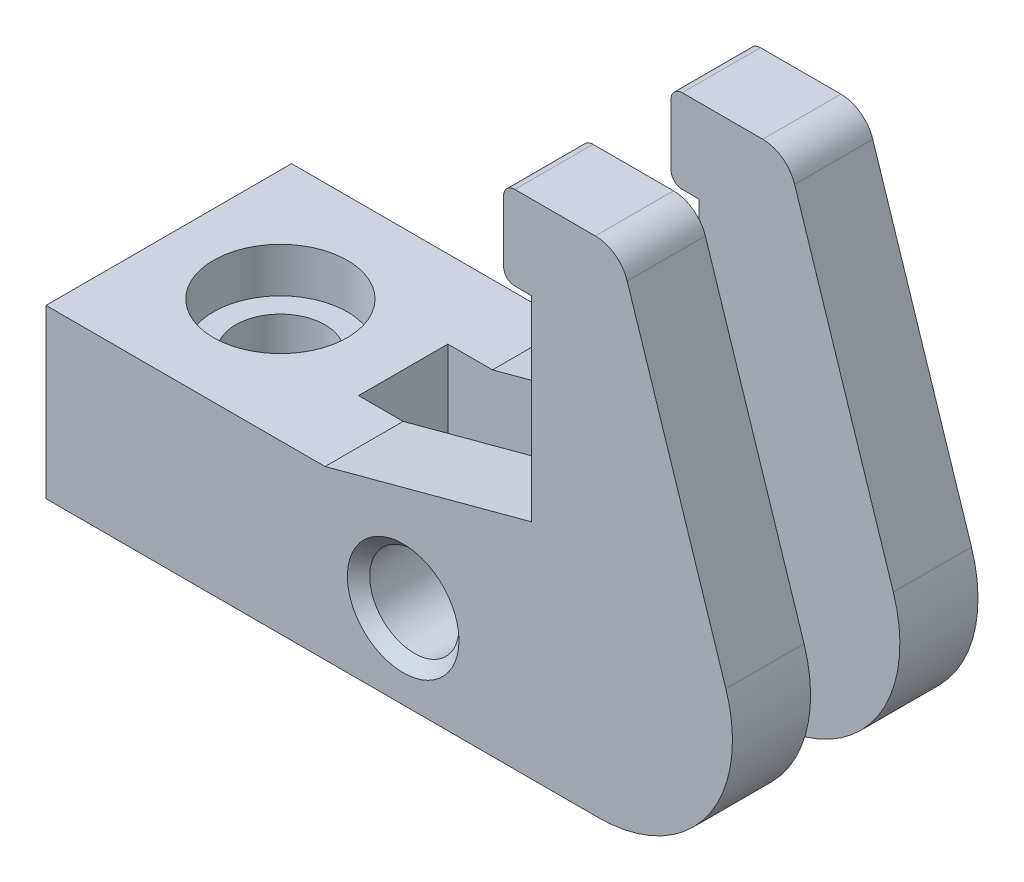
ISO-10303-21;
HEADER;
FILE_DESCRIPTION(('STEP AP214'),'2;1');
FILE_NAME('part.step','',(''),(''),'','','');
FILE_SCHEMA(('AUTOMOTIVE_DESIGN { 1 0 10303 214 1 1 1 1 }'));
ENDSEC;
DATA;
#1=APPLICATION_CONTEXT('core data for automotive mechanical design processes');
#2=APPLICATION_PROTOCOL_DEFINITION('international standard','automotive_design',2000,#1);
#3=PRODUCT_CONTEXT('',#1,'mechanical');
#4=PRODUCT('Part','Part','',(#3));
#5=PRODUCT_RELATED_PRODUCT_CATEGORY('part','',(#4));
#6=PRODUCT_DEFINITION_FORMATION('','',#4);
#7=PRODUCT_DEFINITION_CONTEXT('part definition',#1,'design');
#8=PRODUCT_DEFINITION('design','',#6,#7);
#9=PRODUCT_DEFINITION_SHAPE('','',#8);
#10=(LENGTH_UNIT() NAMED_UNIT(*) SI_UNIT(.MILLI.,.METRE.));
#11=(NAMED_UNIT(*) PLANE_ANGLE_UNIT() SI_UNIT($,.RADIAN.));
#12=(NAMED_UNIT(*) SI_UNIT($,.STERADIAN.) SOLID_ANGLE_UNIT());
#13=UNCERTAINTY_MEASURE_WITH_UNIT(LENGTH_MEASURE(1.E-05),#10,'distance_accuracy_value','');
#14=(GEOMETRIC_REPRESENTATION_CONTEXT(3) GLOBAL_UNCERTAINTY_ASSIGNED_CONTEXT((#13)) GLOBAL_UNIT_ASSIGNED_CONTEXT((#10,
#11,#12)) REPRESENTATION_CONTEXT('',''));
#15=CARTESIAN_POINT('',(0.,0.,0.));
#16=DIRECTION('',(0.,0.,1.));
#17=DIRECTION('',(1.,0.,0.));
#18=AXIS2_PLACEMENT_3D('',#15,#16,#17);
#19=CARTESIAN_POINT('',(0.,0.,11.));
#20=DIRECTION('',(0.,1.,0.));
#21=DIRECTION('',(0.,0.,1.));
#22=AXIS2_PLACEMENT_3D('',#19,#20,#21);
#23=PLANE('',#22);
#24=CARTESIAN_POINT('',(10.,0.,0.));
#25=DIRECTION('',(0.,1.,0.));
#26=DIRECTION('',(0.,0.,1.));
#27=AXIS2_PLACEMENT_3D('',#24,#25,#26);
#28=CIRCLE('',#27,4.);
#29=CARTESIAN_POINT('',(10.,0.,4.));
#30=VERTEX_POINT('',#29);
#31=EDGE_CURVE('E509',#30,#30,#28,.T.);
#32=ORIENTED_EDGE('',*,*,#31,.T.);
#33=EDGE_LOOP('',(#32));
#34=FACE_BOUND('',#33,.T.);
#35=DIRECTION('',(-1.,0.,0.));
#36=VECTOR('',#35,1.);
#37=CARTESIAN_POINT('',(0.,0.,4.));
#38=LINE('',#37,#36);
#39=CARTESIAN_POINT('',(49.5,0.,4.));
#40=VERTEX_POINT('',#39);
#41=CARTESIAN_POINT('',(21.,0.,4.));
#42=VERTEX_POINT('',#41);
#43=EDGE_CURVE('E561',#40,#42,#38,.T.);
#44=ORIENTED_EDGE('',*,*,#43,.F.);
#45=DIRECTION('',(0.,0.,-1.));
#46=VECTOR('',#45,1.);
#47=CARTESIAN_POINT('',(49.5,0.,11.));
#48=LINE('',#47,#46);
#49=CARTESIAN_POINT('',(49.5,0.,11.));
#50=VERTEX_POINT('',#49);
#51=EDGE_CURVE('E436',#50,#40,#48,.T.);
#52=ORIENTED_EDGE('',*,*,#51,.F.);
#53=DIRECTION('',(1.,0.,0.));
#54=VECTOR('',#53,1.);
#55=CARTESIAN_POINT('',(0.,0.,11.));
#56=LINE('',#55,#54);
#57=CARTESIAN_POINT('',(0.,0.,11.));
#58=VERTEX_POINT('',#57);
#59=EDGE_CURVE('E406',#58,#50,#56,.T.);
#60=ORIENTED_EDGE('',*,*,#59,.F.);
#61=DIRECTION('',(0.,0.,-1.));
#62=VECTOR('',#61,1.);
#63=CARTESIAN_POINT('',(0.,0.,11.));
#64=LINE('',#63,#62);
#65=CARTESIAN_POINT('',(0.,0.,-11.));
#66=VERTEX_POINT('',#65);
#67=EDGE_CURVE('E407',#58,#66,#64,.T.);
#68=ORIENTED_EDGE('',*,*,#67,.T.);
#69=DIRECTION('',(1.,0.,0.));
#70=VECTOR('',#69,1.);
#71=CARTESIAN_POINT('',(0.,0.,-11.));
#72=LINE('',#71,#70);
#73=CARTESIAN_POINT('',(49.5,0.,-11.));
#74=VERTEX_POINT('',#73);
#75=EDGE_CURVE('E504',#66,#74,#72,.T.);
#76=ORIENTED_EDGE('',*,*,#75,.T.);
#77=CARTESIAN_POINT('',(49.5,0.,-4.));
#78=VERTEX_POINT('',#77);
#79=EDGE_CURVE('E435',#78,#74,#48,.T.);
#80=ORIENTED_EDGE('',*,*,#79,.F.);
#81=DIRECTION('',(1.,0.,0.));
#82=VECTOR('',#81,1.);
#83=CARTESIAN_POINT('',(0.,0.,-4.));
#84=LINE('',#83,#82);
#85=CARTESIAN_POINT('',(21.,0.,-4.));
#86=VERTEX_POINT('',#85);
#87=EDGE_CURVE('E533',#86,#78,#84,.T.);
#88=ORIENTED_EDGE('',*,*,#87,.F.);
#89=DIRECTION('',(0.,0.,-1.));
#90=VECTOR('',#89,1.);
#91=CARTESIAN_POINT('',(21.,0.,11.));
#92=LINE('',#91,#90);
#93=EDGE_CURVE('E239',#42,#86,#92,.T.);
#94=ORIENTED_EDGE('',*,*,#93,.F.);
#95=EDGE_LOOP('',(#44,#52,#60,#68,#76,#80,#88,#94));
#96=FACE_BOUND('',#95,.T.);
#97=ADVANCED_FACE('F45',(#34,#96),#23,.F.);
#98=CARTESIAN_POINT('',(49.5,12.,11.));
#99=DIRECTION('',(0.,0.,-1.));
#100=DIRECTION('',(-1.,0.,0.));
#101=AXIS2_PLACEMENT_3D('',#98,#99,#100);
#102=CYLINDRICAL_SURFACE('',#101,12.);
#103=CARTESIAN_POINT('',(49.5,12.,4.));
#104=DIRECTION('',(0.,0.,-1.));
#105=DIRECTION('',(-1.,0.,0.));
#106=AXIS2_PLACEMENT_3D('',#103,#104,#105);
#107=CIRCLE('',#106,12.);
#108=CARTESIAN_POINT('',(60.9126781955418,15.7082039324994,4.));
#109=VERTEX_POINT('',#108);
#110=EDGE_CURVE('E558',#109,#40,#107,.T.);
#111=ORIENTED_EDGE('',*,*,#110,.F.);
#112=DIRECTION('',(0.,0.,-1.));
#113=VECTOR('',#112,1.);
#114=CARTESIAN_POINT('',(60.9126781955418,15.7082039324994,11.));
#115=LINE('',#114,#113);
#116=CARTESIAN_POINT('',(60.9126781955418,15.7082039324994,11.));
#117=VERTEX_POINT('',#116);
#118=EDGE_CURVE('E431',#117,#109,#115,.T.);
#119=ORIENTED_EDGE('',*,*,#118,.F.);
#120=CARTESIAN_POINT('',(49.5,12.,11.));
#121=DIRECTION('',(0.,0.,1.));
#122=DIRECTION('',(1.,0.,0.));
#123=AXIS2_PLACEMENT_3D('',#120,#121,#122);
#124=CIRCLE('',#123,12.);
#125=EDGE_CURVE('E470',#50,#117,#124,.T.);
#126=ORIENTED_EDGE('',*,*,#125,.F.);
#127=ORIENTED_EDGE('',*,*,#51,.T.);
#128=EDGE_LOOP('',(#111,#119,#126,#127));
#129=FACE_BOUND('',#128,.T.);
#130=ADVANCED_FACE('F285',(#129),#102,.T.);
#131=CARTESIAN_POINT('',(60.9126781955418,15.7082039324994,-4.));
#132=VERTEX_POINT('',#131);
#133=CARTESIAN_POINT('',(60.9126781955418,15.7082039324994,-11.));
#134=VERTEX_POINT('',#133);
#135=EDGE_CURVE('E430',#132,#134,#115,.T.);
#136=ORIENTED_EDGE('',*,*,#135,.F.);
#137=CARTESIAN_POINT('',(49.5,12.,-4.));
#138=DIRECTION('',(0.,0.,1.));
#139=DIRECTION('',(1.,0.,0.));
#140=AXIS2_PLACEMENT_3D('',#137,#138,#139);
#141=CIRCLE('',#140,12.);
#142=EDGE_CURVE('E527',#78,#132,#141,.T.);
#143=ORIENTED_EDGE('',*,*,#142,.F.);
#144=ORIENTED_EDGE('',*,*,#79,.T.);
#145=CARTESIAN_POINT('',(49.5,12.,-11.));
#146=DIRECTION('',(0.,0.,1.));
#147=DIRECTION('',(1.,0.,0.));
#148=AXIS2_PLACEMENT_3D('',#145,#146,#147);
#149=CIRCLE('',#148,12.);
#150=EDGE_CURVE('E508',#74,#134,#149,.T.);
#151=ORIENTED_EDGE('',*,*,#150,.T.);
#152=EDGE_LOOP('',(#136,#143,#144,#151));
#153=FACE_BOUND('',#152,.T.);
#154=ADVANCED_FACE('F291',(#153),#102,.T.);
#155=CARTESIAN_POINT('',(60.9126781955418,15.7082039324994,11.));
#156=DIRECTION('',(-0.951056516295153,-0.309016994374948,0.));
#157=DIRECTION('',(0.309016994374948,-0.951056516295153,0.));
#158=AXIS2_PLACEMENT_3D('',#155,#156,#157);
#159=PLANE('',#158);
#160=DIRECTION('',(0.309016994374948,-0.951056516295153,0.));
#161=VECTOR('',#160,1.);
#162=CARTESIAN_POINT('',(60.9126781955418,15.7082039324994,4.));
#163=LINE('',#162,#161);
#164=CARTESIAN_POINT('',(52.0687386800426,42.9270509831248,4.));
#165=VERTEX_POINT('',#164);
#166=EDGE_CURVE('E463',#165,#109,#163,.T.);
#167=ORIENTED_EDGE('',*,*,#166,.F.);
#168=DIRECTION('',(0.,0.,-1.));
#169=VECTOR('',#168,1.);
#170=CARTESIAN_POINT('',(52.0687386800426,42.9270509831248,11.));
#171=LINE('',#170,#169);
#172=CARTESIAN_POINT('',(52.0687386800426,42.9270509831248,11.));
#173=VERTEX_POINT('',#172);
#174=EDGE_CURVE('E447',#165,#173,#171,.F.);
#175=ORIENTED_EDGE('',*,*,#174,.T.);
#176=DIRECTION('',(-0.309016994374948,0.951056516295153,0.));
#177=VECTOR('',#176,1.);
#178=CARTESIAN_POINT('',(60.9126781955418,15.7082039324994,11.));
#179=LINE('',#178,#177);
#180=EDGE_CURVE('E461',#117,#173,#179,.T.);
#181=ORIENTED_EDGE('',*,*,#180,.F.);
#182=ORIENTED_EDGE('',*,*,#118,.T.);
#183=EDGE_LOOP('',(#167,#175,#181,#182));
#184=FACE_BOUND('',#183,.T.);
#185=ADVANCED_FACE('F460',(#184),#159,.F.);
#186=DIRECTION('',(-0.309016994374948,0.951056516295153,0.));
#187=VECTOR('',#186,1.);
#188=CARTESIAN_POINT('',(60.9126781955418,15.7082039324994,-4.));
#189=LINE('',#188,#187);
#190=CARTESIAN_POINT('',(52.0687386800426,42.9270509831248,-4.));
#191=VERTEX_POINT('',#190);
#192=EDGE_CURVE('E524',#132,#191,#189,.T.);
#193=ORIENTED_EDGE('',*,*,#192,.F.);
#194=ORIENTED_EDGE('',*,*,#135,.T.);
#195=DIRECTION('',(-0.309016994374948,0.951056516295153,0.));
#196=VECTOR('',#195,1.);
#197=CARTESIAN_POINT('',(60.9126781955418,15.7082039324994,-11.));
#198=LINE('',#197,#196);
#199=CARTESIAN_POINT('',(52.0687386800426,42.9270509831248,-11.));
#200=VERTEX_POINT('',#199);
#201=EDGE_CURVE('E389',#134,#200,#198,.T.);
#202=ORIENTED_EDGE('',*,*,#201,.T.);
#203=EDGE_CURVE('E339',#200,#191,#171,.F.);
#204=ORIENTED_EDGE('',*,*,#203,.T.);
#205=EDGE_LOOP('',(#193,#194,#202,#204));
#206=FACE_BOUND('',#205,.T.);
#207=ADVANCED_FACE('F514',(#206),#159,.F.);
#208=CARTESIAN_POINT('',(41.,45.,11.));
#209=DIRECTION('',(0.,-1.,0.));
#210=DIRECTION('',(0.,0.,-1.));
#211=AXIS2_PLACEMENT_3D('',#208,#209,#210);
#212=PLANE('',#211);
#213=DIRECTION('',(1.,0.,0.));
#214=VECTOR('',#213,1.);
#215=CARTESIAN_POINT('',(21.,45.,4.));
#216=LINE('',#215,#214);
#217=CARTESIAN_POINT('',(42.,45.,4.));
#218=VERTEX_POINT('',#217);
#219=CARTESIAN_POINT('',(49.2155691311572,45.,4.));
#220=VERTEX_POINT('',#219);
#221=EDGE_CURVE('E480',#218,#220,#216,.T.);
#222=ORIENTED_EDGE('',*,*,#221,.F.);
#223=DIRECTION('',(0.,0.,-1.));
#224=VECTOR('',#223,1.);
#225=CARTESIAN_POINT('',(42.,45.,11.));
#226=LINE('',#225,#224);
#227=CARTESIAN_POINT('',(42.,45.,11.));
#228=VERTEX_POINT('',#227);
#229=EDGE_CURVE('E353',#218,#228,#226,.F.);
#230=ORIENTED_EDGE('',*,*,#229,.T.);
#231=DIRECTION('',(-1.,0.,0.));
#232=VECTOR('',#231,1.);
#233=CARTESIAN_POINT('',(41.,45.,11.));
#234=LINE('',#233,#232);
#235=CARTESIAN_POINT('',(49.2155691311572,45.,11.));
#236=VERTEX_POINT('',#235);
#237=EDGE_CURVE('E473',#236,#228,#234,.T.);
#238=ORIENTED_EDGE('',*,*,#237,.F.);
#239=DIRECTION('',(0.,0.,-1.));
#240=VECTOR('',#239,1.);
#241=CARTESIAN_POINT('',(49.2155691311572,45.,11.));
#242=LINE('',#241,#240);
#243=EDGE_CURVE('E441',#236,#220,#242,.T.);
#244=ORIENTED_EDGE('',*,*,#243,.T.);
#245=EDGE_LOOP('',(#222,#230,#238,#244));
#246=FACE_BOUND('',#245,.T.);
#247=ADVANCED_FACE('F479',(#246),#212,.F.);
#248=DIRECTION('',(-1.,0.,0.));
#249=VECTOR('',#248,1.);
#250=CARTESIAN_POINT('',(21.,45.,-4.));
#251=LINE('',#250,#249);
#252=CARTESIAN_POINT('',(49.2155691311572,45.,-4.));
#253=VERTEX_POINT('',#252);
#254=CARTESIAN_POINT('',(42.,45.,-4.));
#255=VERTEX_POINT('',#254);
#256=EDGE_CURVE('E242',#253,#255,#251,.T.);
#257=ORIENTED_EDGE('',*,*,#256,.F.);
#258=CARTESIAN_POINT('',(49.2155691311572,45.,-11.));
#259=VERTEX_POINT('',#258);
#260=EDGE_CURVE('E440',#253,#259,#242,.T.);
#261=ORIENTED_EDGE('',*,*,#260,.T.);
#262=DIRECTION('',(-1.,0.,0.));
#263=VECTOR('',#262,1.);
#264=CARTESIAN_POINT('',(41.,45.,-11.));
#265=LINE('',#264,#263);
#266=CARTESIAN_POINT('',(42.,45.,-11.));
#267=VERTEX_POINT('',#266);
#268=EDGE_CURVE('E381',#259,#267,#265,.T.);
#269=ORIENTED_EDGE('',*,*,#268,.T.);
#270=EDGE_CURVE('E354',#267,#255,#226,.F.);
#271=ORIENTED_EDGE('',*,*,#270,.T.);
#272=EDGE_LOOP('',(#257,#261,#269,#271));
#273=FACE_BOUND('',#272,.T.);
#274=ADVANCED_FACE('F658',(#273),#212,.F.);
#275=CARTESIAN_POINT('',(41.,37.5,11.));
#276=DIRECTION('',(1.,0.,0.));
#277=DIRECTION('',(0.,1.,0.));
#278=AXIS2_PLACEMENT_3D('',#275,#276,#277);
#279=PLANE('',#278);
#280=DIRECTION('',(0.,1.,0.));
#281=VECTOR('',#280,1.);
#282=CARTESIAN_POINT('',(41.,37.5,4.));
#283=LINE('',#282,#281);
#284=CARTESIAN_POINT('',(41.,38.5,4.));
#285=VERTEX_POINT('',#284);
#286=CARTESIAN_POINT('',(41.,44.,4.));
#287=VERTEX_POINT('',#286);
#288=EDGE_CURVE('E539',#285,#287,#283,.T.);
#289=ORIENTED_EDGE('',*,*,#288,.F.);
#290=DIRECTION('',(0.,0.,-1.));
#291=VECTOR('',#290,1.);
#292=CARTESIAN_POINT('',(41.,38.5,11.));
#293=LINE('',#292,#291);
#294=CARTESIAN_POINT('',(41.,38.5,11.));
#295=VERTEX_POINT('',#294);
#296=EDGE_CURVE('E325',#285,#295,#293,.F.);
#297=ORIENTED_EDGE('',*,*,#296,.T.);
#298=DIRECTION('',(0.,-1.,0.));
#299=VECTOR('',#298,1.);
#300=CARTESIAN_POINT('',(41.,37.5,11.));
#301=LINE('',#300,#299);
#302=CARTESIAN_POINT('',(41.,44.,11.));
#303=VERTEX_POINT('',#302);
#304=EDGE_CURVE('E484',#303,#295,#301,.T.);
#305=ORIENTED_EDGE('',*,*,#304,.F.);
#306=DIRECTION('',(0.,0.,-1.));
#307=VECTOR('',#306,1.);
#308=CARTESIAN_POINT('',(41.,44.,11.));
#309=LINE('',#308,#307);
#310=EDGE_CURVE('E343',#303,#287,#309,.T.);
#311=ORIENTED_EDGE('',*,*,#310,.T.);
#312=EDGE_LOOP('',(#289,#297,#305,#311));
#313=FACE_BOUND('',#312,.T.);
#314=ADVANCED_FACE('F655',(#313),#279,.F.);
#315=DIRECTION('',(0.,-1.,0.));
#316=VECTOR('',#315,1.);
#317=CARTESIAN_POINT('',(41.,37.5,-4.));
#318=LINE('',#317,#316);
#319=CARTESIAN_POINT('',(41.,44.,-4.));
#320=VERTEX_POINT('',#319);
#321=CARTESIAN_POINT('',(41.,38.5,-4.));
#322=VERTEX_POINT('',#321);
#323=EDGE_CURVE('E62',#320,#322,#318,.T.);
#324=ORIENTED_EDGE('',*,*,#323,.F.);
#325=CARTESIAN_POINT('',(41.,44.,-11.));
#326=VERTEX_POINT('',#325);
#327=EDGE_CURVE('E338',#320,#326,#309,.T.);
#328=ORIENTED_EDGE('',*,*,#327,.T.);
#329=DIRECTION('',(0.,-1.,0.));
#330=VECTOR('',#329,1.);
#331=CARTESIAN_POINT('',(41.,37.5,-11.));
#332=LINE('',#331,#330);
#333=CARTESIAN_POINT('',(41.,38.5,-11.));
#334=VERTEX_POINT('',#333);
#335=EDGE_CURVE('E376',#326,#334,#332,.T.);
#336=ORIENTED_EDGE('',*,*,#335,.T.);
#337=EDGE_CURVE('E332',#334,#322,#293,.F.);
#338=ORIENTED_EDGE('',*,*,#337,.T.);
#339=EDGE_LOOP('',(#324,#328,#336,#338));
#340=FACE_BOUND('',#339,.T.);
#341=ADVANCED_FACE('F373',(#340),#279,.F.);
#342=CARTESIAN_POINT('',(43.5,37.5,11.));
#343=DIRECTION('',(0.,1.,0.));
#344=DIRECTION('',(0.,0.,1.));
#345=AXIS2_PLACEMENT_3D('',#342,#343,#344);
#346=PLANE('',#345);
#347=DIRECTION('',(-1.,0.,0.));
#348=VECTOR('',#347,1.);
#349=CARTESIAN_POINT('',(43.5,37.5,4.));
#350=LINE('',#349,#348);
#351=CARTESIAN_POINT('',(43.5,37.5,4.));
#352=VERTEX_POINT('',#351);
#353=CARTESIAN_POINT('',(42.,37.5,4.));
#354=VERTEX_POINT('',#353);
#355=EDGE_CURVE('E536',#352,#354,#350,.T.);
#356=ORIENTED_EDGE('',*,*,#355,.F.);
#357=DIRECTION('',(0.,0.,-1.));
#358=VECTOR('',#357,1.);
#359=CARTESIAN_POINT('',(43.5,37.5,11.));
#360=LINE('',#359,#358);
#361=CARTESIAN_POINT('',(43.5,37.5,11.));
#362=VERTEX_POINT('',#361);
#363=EDGE_CURVE('E426',#362,#352,#360,.T.);
#364=ORIENTED_EDGE('',*,*,#363,.F.);
#365=DIRECTION('',(1.,0.,0.));
#366=VECTOR('',#365,1.);
#367=CARTESIAN_POINT('',(43.5,37.5,11.));
#368=LINE('',#367,#366);
#369=CARTESIAN_POINT('',(42.,37.5,11.));
#370=VERTEX_POINT('',#369);
#371=EDGE_CURVE('E487',#370,#362,#368,.T.);
#372=ORIENTED_EDGE('',*,*,#371,.F.);
#373=DIRECTION('',(0.,0.,-1.));
#374=VECTOR('',#373,1.);
#375=CARTESIAN_POINT('',(42.,37.5,11.));
#376=LINE('',#375,#374);
#377=EDGE_CURVE('E364',#370,#354,#376,.T.);
#378=ORIENTED_EDGE('',*,*,#377,.T.);
#379=EDGE_LOOP('',(#356,#364,#372,#378));
#380=FACE_BOUND('',#379,.T.);
#381=ADVANCED_FACE('F644',(#380),#346,.F.);
#382=DIRECTION('',(1.,0.,0.));
#383=VECTOR('',#382,1.);
#384=CARTESIAN_POINT('',(43.5,37.5,-4.));
#385=LINE('',#384,#383);
#386=CARTESIAN_POINT('',(42.,37.5,-4.));
#387=VERTEX_POINT('',#386);
#388=CARTESIAN_POINT('',(43.5,37.5,-4.));
#389=VERTEX_POINT('',#388);
#390=EDGE_CURVE('E599',#387,#389,#385,.T.);
#391=ORIENTED_EDGE('',*,*,#390,.F.);
#392=CARTESIAN_POINT('',(42.,37.5,-11.));
#393=VERTEX_POINT('',#392);
#394=EDGE_CURVE('E363',#387,#393,#376,.T.);
#395=ORIENTED_EDGE('',*,*,#394,.T.);
#396=DIRECTION('',(1.,0.,0.));
#397=VECTOR('',#396,1.);
#398=CARTESIAN_POINT('',(43.5,37.5,-11.));
#399=LINE('',#398,#397);
#400=CARTESIAN_POINT('',(43.5,37.5,-11.));
#401=VERTEX_POINT('',#400);
#402=EDGE_CURVE('E380',#393,#401,#399,.T.);
#403=ORIENTED_EDGE('',*,*,#402,.T.);
#404=EDGE_CURVE('E425',#389,#401,#360,.T.);
#405=ORIENTED_EDGE('',*,*,#404,.F.);
#406=EDGE_LOOP('',(#391,#395,#403,#405));
#407=FACE_BOUND('',#406,.T.);
#408=ADVANCED_FACE('F638',(#407),#346,.F.);
#409=CARTESIAN_POINT('',(43.5,19.9570600599758,11.));
#410=DIRECTION('',(1.,0.,0.));
#411=DIRECTION('',(0.,0.,-1.));
#412=AXIS2_PLACEMENT_3D('',#409,#410,#411);
#413=PLANE('',#412);
#414=DIRECTION('',(0.,1.,0.));
#415=VECTOR('',#414,1.);
#416=CARTESIAN_POINT('',(43.5,19.9570600599758,4.));
#417=LINE('',#416,#415);
#418=CARTESIAN_POINT('',(43.5,19.9570600599758,4.));
#419=VERTEX_POINT('',#418);
#420=EDGE_CURVE('E546',#419,#352,#417,.T.);
#421=ORIENTED_EDGE('',*,*,#420,.F.);
#422=DIRECTION('',(0.,0.,-1.));
#423=VECTOR('',#422,1.);
#424=CARTESIAN_POINT('',(43.5,19.9570600599758,11.));
#425=LINE('',#424,#423);
#426=CARTESIAN_POINT('',(43.5,19.9570600599758,11.));
#427=VERTEX_POINT('',#426);
#428=EDGE_CURVE('E421',#427,#419,#425,.T.);
#429=ORIENTED_EDGE('',*,*,#428,.F.);
#430=DIRECTION('',(0.,-1.,0.));
#431=VECTOR('',#430,1.);
#432=CARTESIAN_POINT('',(43.5,19.9570600599758,11.));
#433=LINE('',#432,#431);
#434=EDGE_CURVE('E493',#362,#427,#433,.T.);
#435=ORIENTED_EDGE('',*,*,#434,.F.);
#436=ORIENTED_EDGE('',*,*,#363,.T.);
#437=EDGE_LOOP('',(#421,#429,#435,#436));
#438=FACE_BOUND('',#437,.T.);
#439=ADVANCED_FACE('F643',(#438),#413,.F.);
#440=DIRECTION('',(0.,-1.,0.));
#441=VECTOR('',#440,1.);
#442=CARTESIAN_POINT('',(43.5,19.9570600599758,-4.));
#443=LINE('',#442,#441);
#444=CARTESIAN_POINT('',(43.5,19.9570600599758,-4.));
#445=VERTEX_POINT('',#444);
#446=EDGE_CURVE('E608',#389,#445,#443,.T.);
#447=ORIENTED_EDGE('',*,*,#446,.F.);
#448=ORIENTED_EDGE('',*,*,#404,.T.);
#449=DIRECTION('',(0.,-1.,0.));
#450=VECTOR('',#449,1.);
#451=CARTESIAN_POINT('',(43.5,19.9570600599758,-11.));
#452=LINE('',#451,#450);
#453=CARTESIAN_POINT('',(43.5,19.9570600599758,-11.));
#454=VERTEX_POINT('',#453);
#455=EDGE_CURVE('E386',#401,#454,#452,.T.);
#456=ORIENTED_EDGE('',*,*,#455,.T.);
#457=EDGE_CURVE('E420',#445,#454,#425,.T.);
#458=ORIENTED_EDGE('',*,*,#457,.F.);
#459=EDGE_LOOP('',(#447,#448,#456,#458));
#460=FACE_BOUND('',#459,.T.);
#461=ADVANCED_FACE('F617',(#460),#413,.F.);
#462=CARTESIAN_POINT('',(25.,15.,11.));
#463=DIRECTION('',(0.258819045102522,-0.965925826289068,0.));
#464=DIRECTION('',(0.965925826289068,0.258819045102522,0.));
#465=AXIS2_PLACEMENT_3D('',#462,#463,#464);
#466=PLANE('',#465);
#467=DIRECTION('',(0.965925826289068,0.258819045102522,0.));
#468=VECTOR('',#467,1.);
#469=CARTESIAN_POINT('',(25.,15.,4.));
#470=LINE('',#469,#468);
#471=CARTESIAN_POINT('',(25.,15.,4.));
#472=VERTEX_POINT('',#471);
#473=EDGE_CURVE('E549',#472,#419,#470,.T.);
#474=ORIENTED_EDGE('',*,*,#473,.F.);
#475=DIRECTION('',(0.,0.,-1.));
#476=VECTOR('',#475,1.);
#477=CARTESIAN_POINT('',(25.,15.,11.));
#478=LINE('',#477,#476);
#479=CARTESIAN_POINT('',(25.,15.,11.));
#480=VERTEX_POINT('',#479);
#481=EDGE_CURVE('E417',#480,#472,#478,.T.);
#482=ORIENTED_EDGE('',*,*,#481,.F.);
#483=DIRECTION('',(-0.965925826289068,-0.258819045102522,0.));
#484=VECTOR('',#483,1.);
#485=CARTESIAN_POINT('',(25.,15.,11.));
#486=LINE('',#485,#484);
#487=EDGE_CURVE('E496',#427,#480,#486,.T.);
#488=ORIENTED_EDGE('',*,*,#487,.F.);
#489=ORIENTED_EDGE('',*,*,#428,.T.);
#490=EDGE_LOOP('',(#474,#482,#488,#489));
#491=FACE_BOUND('',#490,.T.);
#492=ADVANCED_FACE('F856',(#491),#466,.F.);
#493=DIRECTION('',(-0.965925826289068,-0.258819045102522,0.));
#494=VECTOR('',#493,1.);
#495=CARTESIAN_POINT('',(25.,15.,-4.));
#496=LINE('',#495,#494);
#497=CARTESIAN_POINT('',(25.,15.,-4.));
#498=VERTEX_POINT('',#497);
#499=EDGE_CURVE('E226',#445,#498,#496,.T.);
#500=ORIENTED_EDGE('',*,*,#499,.F.);
#501=ORIENTED_EDGE('',*,*,#457,.T.);
#502=DIRECTION('',(-0.965925826289068,-0.258819045102522,0.));
#503=VECTOR('',#502,1.);
#504=CARTESIAN_POINT('',(25.,15.,-11.));
#505=LINE('',#504,#503);
#506=CARTESIAN_POINT('',(25.,15.,-11.));
#507=VERTEX_POINT('',#506);
#508=EDGE_CURVE('E396',#454,#507,#505,.T.);
#509=ORIENTED_EDGE('',*,*,#508,.T.);
#510=EDGE_CURVE('E416',#498,#507,#478,.T.);
#511=ORIENTED_EDGE('',*,*,#510,.F.);
#512=EDGE_LOOP('',(#500,#501,#509,#511));
#513=FACE_BOUND('',#512,.T.);
#514=ADVANCED_FACE('F616',(#513),#466,.F.);
#515=CARTESIAN_POINT('',(0.,15.,11.));
#516=DIRECTION('',(0.,-1.,0.));
#517=DIRECTION('',(0.,0.,-1.));
#518=AXIS2_PLACEMENT_3D('',#515,#516,#517);
#519=PLANE('',#518);
#520=CARTESIAN_POINT('',(10.,15.,0.));
#521=DIRECTION('',(0.,1.,0.));
#522=DIRECTION('',(0.,0.,1.));
#523=AXIS2_PLACEMENT_3D('',#520,#521,#522);
#524=CIRCLE('',#523,6.);
#525=CARTESIAN_POINT('',(10.,15.,6.));
#526=VERTEX_POINT('',#525);
#527=EDGE_CURVE('E570',#526,#526,#524,.T.);
#528=ORIENTED_EDGE('',*,*,#527,.F.);
#529=EDGE_LOOP('',(#528));
#530=FACE_BOUND('',#529,.T.);
#531=DIRECTION('',(1.,0.,0.));
#532=VECTOR('',#531,1.);
#533=CARTESIAN_POINT('',(0.,15.,4.));
#534=LINE('',#533,#532);
#535=CARTESIAN_POINT('',(21.,15.,4.));
#536=VERTEX_POINT('',#535);
#537=EDGE_CURVE('E247',#536,#472,#534,.T.);
#538=ORIENTED_EDGE('',*,*,#537,.F.);
#539=DIRECTION('',(0.,0.,1.));
#540=VECTOR('',#539,1.);
#541=CARTESIAN_POINT('',(21.,15.,11.));
#542=LINE('',#541,#540);
#543=CARTESIAN_POINT('',(21.,15.,-4.));
#544=VERTEX_POINT('',#543);
#545=EDGE_CURVE('E236',#544,#536,#542,.T.);
#546=ORIENTED_EDGE('',*,*,#545,.F.);
#547=DIRECTION('',(-1.,0.,0.));
#548=VECTOR('',#547,1.);
#549=CARTESIAN_POINT('',(0.,15.,-4.));
#550=LINE('',#549,#548);
#551=EDGE_CURVE('E220',#498,#544,#550,.T.);
#552=ORIENTED_EDGE('',*,*,#551,.F.);
#553=ORIENTED_EDGE('',*,*,#510,.T.);
#554=DIRECTION('',(-1.,0.,0.));
#555=VECTOR('',#554,1.);
#556=CARTESIAN_POINT('',(0.,15.,-11.));
#557=LINE('',#556,#555);
#558=CARTESIAN_POINT('',(0.,15.,-11.));
#559=VERTEX_POINT('',#558);
#560=EDGE_CURVE('E400',#507,#559,#557,.T.);
#561=ORIENTED_EDGE('',*,*,#560,.T.);
#562=DIRECTION('',(0.,0.,-1.));
#563=VECTOR('',#562,1.);
#564=CARTESIAN_POINT('',(0.,15.,11.));
#565=LINE('',#564,#563);
#566=CARTESIAN_POINT('',(0.,15.,11.));
#567=VERTEX_POINT('',#566);
#568=EDGE_CURVE('E411',#567,#559,#565,.T.);
#569=ORIENTED_EDGE('',*,*,#568,.F.);
#570=DIRECTION('',(-1.,0.,0.));
#571=VECTOR('',#570,1.);
#572=CARTESIAN_POINT('',(0.,15.,11.));
#573=LINE('',#572,#571);
#574=EDGE_CURVE('E499',#480,#567,#573,.T.);
#575=ORIENTED_EDGE('',*,*,#574,.F.);
#576=ORIENTED_EDGE('',*,*,#481,.T.);
#577=EDGE_LOOP('',(#538,#546,#552,#553,#561,#569,#575,#576));
#578=FACE_BOUND('',#577,.T.);
#579=ADVANCED_FACE('F245',(#530,#578),#519,.F.);
#580=CARTESIAN_POINT('',(49.2155691311572,42.,11.));
#581=DIRECTION('',(0.,0.,-1.));
#582=DIRECTION('',(-1.,0.,0.));
#583=AXIS2_PLACEMENT_3D('',#580,#581,#582);
#584=CYLINDRICAL_SURFACE('',#583,3.);
#585=ORIENTED_EDGE('',*,*,#174,.F.);
#586=CARTESIAN_POINT('',(49.2155691311572,42.,4.));
#587=DIRECTION('',(0.,0.,-1.));
#588=DIRECTION('',(-1.,0.,0.));
#589=AXIS2_PLACEMENT_3D('',#586,#587,#588);
#590=CIRCLE('',#589,3.);
#591=EDGE_CURVE('E476',#165,#220,#590,.F.);
#592=ORIENTED_EDGE('',*,*,#591,.T.);
#593=ORIENTED_EDGE('',*,*,#243,.F.);
#594=CARTESIAN_POINT('',(49.2155691311572,42.,11.));
#595=DIRECTION('',(0.,0.,1.));
#596=DIRECTION('',(1.,0.,0.));
#597=AXIS2_PLACEMENT_3D('',#594,#595,#596);
#598=CIRCLE('',#597,3.);
#599=EDGE_CURVE('E333',#173,#236,#598,.T.);
#600=ORIENTED_EDGE('',*,*,#599,.F.);
#601=EDGE_LOOP('',(#585,#592,#593,#600));
#602=FACE_BOUND('',#601,.T.);
#603=ADVANCED_FACE('F298',(#602),#584,.T.);
#604=ORIENTED_EDGE('',*,*,#260,.F.);
#605=CARTESIAN_POINT('',(49.2155691311572,42.,-4.));
#606=DIRECTION('',(0.,0.,1.));
#607=DIRECTION('',(1.,0.,0.));
#608=AXIS2_PLACEMENT_3D('',#605,#606,#607);
#609=CIRCLE('',#608,3.);
#610=EDGE_CURVE('E231',#253,#191,#609,.F.);
#611=ORIENTED_EDGE('',*,*,#610,.T.);
#612=ORIENTED_EDGE('',*,*,#203,.F.);
#613=CARTESIAN_POINT('',(49.2155691311572,42.,-11.));
#614=DIRECTION('',(0.,0.,1.));
#615=DIRECTION('',(1.,0.,0.));
#616=AXIS2_PLACEMENT_3D('',#613,#614,#615);
#617=CIRCLE('',#616,3.);
#618=EDGE_CURVE('E445',#259,#200,#617,.F.);
#619=ORIENTED_EDGE('',*,*,#618,.F.);
#620=EDGE_LOOP('',(#604,#611,#612,#619));
#621=FACE_BOUND('',#620,.T.);
#622=ADVANCED_FACE('F301',(#621),#584,.T.);
#623=CARTESIAN_POINT('',(42.,44.,11.));
#624=DIRECTION('',(0.,0.,-1.));
#625=DIRECTION('',(-1.,0.,0.));
#626=AXIS2_PLACEMENT_3D('',#623,#624,#625);
#627=CYLINDRICAL_SURFACE('',#626,1.);
#628=ORIENTED_EDGE('',*,*,#229,.F.);
#629=CARTESIAN_POINT('',(42.,44.,4.));
#630=DIRECTION('',(0.,0.,-1.));
#631=DIRECTION('',(-1.,0.,0.));
#632=AXIS2_PLACEMENT_3D('',#629,#630,#631);
#633=CIRCLE('',#632,1.);
#634=EDGE_CURVE('E542',#218,#287,#633,.F.);
#635=ORIENTED_EDGE('',*,*,#634,.T.);
#636=ORIENTED_EDGE('',*,*,#310,.F.);
#637=CARTESIAN_POINT('',(42.,44.,11.));
#638=DIRECTION('',(0.,0.,1.));
#639=DIRECTION('',(1.,0.,0.));
#640=AXIS2_PLACEMENT_3D('',#637,#638,#639);
#641=CIRCLE('',#640,1.);
#642=EDGE_CURVE('E360',#228,#303,#641,.T.);
#643=ORIENTED_EDGE('',*,*,#642,.F.);
#644=EDGE_LOOP('',(#628,#635,#636,#643));
#645=FACE_BOUND('',#644,.T.);
#646=ADVANCED_FACE('F303',(#645),#627,.T.);
#647=ORIENTED_EDGE('',*,*,#327,.F.);
#648=CARTESIAN_POINT('',(42.,44.,-4.));
#649=DIRECTION('',(0.,0.,1.));
#650=DIRECTION('',(1.,0.,0.));
#651=AXIS2_PLACEMENT_3D('',#648,#649,#650);
#652=CIRCLE('',#651,1.);
#653=EDGE_CURVE('E604',#320,#255,#652,.F.);
#654=ORIENTED_EDGE('',*,*,#653,.T.);
#655=ORIENTED_EDGE('',*,*,#270,.F.);
#656=CARTESIAN_POINT('',(42.,44.,-11.));
#657=DIRECTION('',(0.,0.,1.));
#658=DIRECTION('',(1.,0.,0.));
#659=AXIS2_PLACEMENT_3D('',#656,#657,#658);
#660=CIRCLE('',#659,1.);
#661=EDGE_CURVE('E350',#326,#267,#660,.F.);
#662=ORIENTED_EDGE('',*,*,#661,.F.);
#663=EDGE_LOOP('',(#647,#654,#655,#662));
#664=FACE_BOUND('',#663,.T.);
#665=ADVANCED_FACE('F306',(#664),#627,.T.);
#666=CARTESIAN_POINT('',(42.,38.5,11.));
#667=DIRECTION('',(0.,0.,-1.));
#668=DIRECTION('',(-1.,0.,0.));
#669=AXIS2_PLACEMENT_3D('',#666,#667,#668);
#670=CYLINDRICAL_SURFACE('',#669,1.);
#671=ORIENTED_EDGE('',*,*,#296,.F.);
#672=CARTESIAN_POINT('',(42.,38.5,4.));
#673=DIRECTION('',(0.,0.,-1.));
#674=DIRECTION('',(-1.,0.,0.));
#675=AXIS2_PLACEMENT_3D('',#672,#673,#674);
#676=CIRCLE('',#675,1.);
#677=EDGE_CURVE('E250',#285,#354,#676,.F.);
#678=ORIENTED_EDGE('',*,*,#677,.T.);
#679=ORIENTED_EDGE('',*,*,#377,.F.);
#680=CARTESIAN_POINT('',(42.,38.5,11.));
#681=DIRECTION('',(0.,0.,1.));
#682=DIRECTION('',(1.,0.,0.));
#683=AXIS2_PLACEMENT_3D('',#680,#681,#682);
#684=CIRCLE('',#683,1.);
#685=EDGE_CURVE('E70',#295,#370,#684,.T.);
#686=ORIENTED_EDGE('',*,*,#685,.F.);
#687=EDGE_LOOP('',(#671,#678,#679,#686));
#688=FACE_BOUND('',#687,.T.);
#689=ADVANCED_FACE('F308',(#688),#670,.T.);
#690=ORIENTED_EDGE('',*,*,#394,.F.);
#691=CARTESIAN_POINT('',(42.,38.5,-4.));
#692=DIRECTION('',(0.,0.,1.));
#693=DIRECTION('',(1.,0.,0.));
#694=AXIS2_PLACEMENT_3D('',#691,#692,#693);
#695=CIRCLE('',#694,1.);
#696=EDGE_CURVE('E258',#387,#322,#695,.F.);
#697=ORIENTED_EDGE('',*,*,#696,.T.);
#698=ORIENTED_EDGE('',*,*,#337,.F.);
#699=CARTESIAN_POINT('',(42.,38.5,-11.));
#700=DIRECTION('',(0.,0.,1.));
#701=DIRECTION('',(1.,0.,0.));
#702=AXIS2_PLACEMENT_3D('',#699,#700,#701);
#703=CIRCLE('',#702,1.);
#704=EDGE_CURVE('E347',#393,#334,#703,.F.);
#705=ORIENTED_EDGE('',*,*,#704,.F.);
#706=EDGE_LOOP('',(#690,#697,#698,#705));
#707=FACE_BOUND('',#706,.T.);
#708=ADVANCED_FACE('F310',(#707),#670,.T.);
#709=CARTESIAN_POINT('',(10.,0.,0.));
#710=DIRECTION('',(0.,1.,0.));
#711=DIRECTION('',(0.,0.,1.));
#712=AXIS2_PLACEMENT_3D('',#709,#710,#711);
#713=CYLINDRICAL_SURFACE('',#712,4.);
#714=ORIENTED_EDGE('',*,*,#31,.F.);
#715=EDGE_LOOP('',(#714));
#716=FACE_BOUND('',#715,.T.);
#717=CARTESIAN_POINT('',(10.,11.,0.));
#718=DIRECTION('',(0.,1.,0.));
#719=DIRECTION('',(0.,0.,1.));
#720=AXIS2_PLACEMENT_3D('',#717,#718,#719);
#721=CIRCLE('',#720,4.);
#722=CARTESIAN_POINT('',(10.,11.,4.));
#723=VERTEX_POINT('',#722);
#724=EDGE_CURVE('E566',#723,#723,#721,.T.);
#725=ORIENTED_EDGE('',*,*,#724,.T.);
#726=EDGE_LOOP('',(#725));
#727=FACE_BOUND('',#726,.T.);
#728=ADVANCED_FACE('F321',(#716,#727),#713,.F.);
#729=CARTESIAN_POINT('',(0.,0.,11.));
#730=DIRECTION('',(1.,0.,0.));
#731=DIRECTION('',(0.,0.,-1.));
#732=AXIS2_PLACEMENT_3D('',#729,#730,#731);
#733=PLANE('',#732);
#734=DIRECTION('',(0.,-1.,0.));
#735=VECTOR('',#734,1.);
#736=CARTESIAN_POINT('',(0.,0.,-11.));
#737=LINE('',#736,#735);
#738=EDGE_CURVE('E403',#559,#66,#737,.T.);
#739=ORIENTED_EDGE('',*,*,#738,.T.);
#740=ORIENTED_EDGE('',*,*,#67,.F.);
#741=DIRECTION('',(0.,-1.,0.));
#742=VECTOR('',#741,1.);
#743=CARTESIAN_POINT('',(0.,0.,11.));
#744=LINE('',#743,#742);
#745=EDGE_CURVE('E412',#567,#58,#744,.T.);
#746=ORIENTED_EDGE('',*,*,#745,.F.);
#747=ORIENTED_EDGE('',*,*,#568,.T.);
#748=EDGE_LOOP('',(#739,#740,#746,#747));
#749=FACE_BOUND('',#748,.T.);
#750=ADVANCED_FACE('F629',(#749),#733,.F.);
#751=CARTESIAN_POINT('',(49.5,12.,11.));
#752=DIRECTION('',(0.,0.,1.));
#753=DIRECTION('',(1.,0.,0.));
#754=AXIS2_PLACEMENT_3D('',#751,#752,#753);
#755=PLANE('',#754);
#756=CARTESIAN_POINT('',(32.,7.5,11.));
#757=DIRECTION('',(0.,0.,1.));
#758=DIRECTION('',(1.,0.,0.));
#759=AXIS2_PLACEMENT_3D('',#756,#757,#758);
#760=CIRCLE('',#759,5.00000000000002);
#761=CARTESIAN_POINT('',(37.,7.5,11.));
#762=VERTEX_POINT('',#761);
#763=EDGE_CURVE('E11',#762,#762,#760,.F.);
#764=ORIENTED_EDGE('',*,*,#763,.T.);
#765=EDGE_LOOP('',(#764));
#766=FACE_BOUND('',#765,.T.);
#767=ORIENTED_EDGE('',*,*,#237,.T.);
#768=ORIENTED_EDGE('',*,*,#642,.T.);
#769=ORIENTED_EDGE('',*,*,#304,.T.);
#770=ORIENTED_EDGE('',*,*,#685,.T.);
#771=ORIENTED_EDGE('',*,*,#371,.T.);
#772=ORIENTED_EDGE('',*,*,#434,.T.);
#773=ORIENTED_EDGE('',*,*,#487,.T.);
#774=ORIENTED_EDGE('',*,*,#574,.T.);
#775=ORIENTED_EDGE('',*,*,#745,.T.);
#776=ORIENTED_EDGE('',*,*,#59,.T.);
#777=ORIENTED_EDGE('',*,*,#125,.T.);
#778=ORIENTED_EDGE('',*,*,#180,.T.);
#779=ORIENTED_EDGE('',*,*,#599,.T.);
#780=EDGE_LOOP('',(#767,#768,#769,#770,#771,#772,#773,#774,#775,#776,#777,#778,#779));
#781=FACE_BOUND('',#780,.T.);
#782=ADVANCED_FACE('F467',(#766,#781),#755,.T.);
#783=CARTESIAN_POINT('',(49.5,12.,-11.));
#784=DIRECTION('',(0.,0.,1.));
#785=DIRECTION('',(1.,0.,0.));
#786=AXIS2_PLACEMENT_3D('',#783,#784,#785);
#787=PLANE('',#786);
#788=CARTESIAN_POINT('',(32.,7.5,-11.));
#789=DIRECTION('',(0.,0.,1.));
#790=DIRECTION('',(1.,0.,0.));
#791=AXIS2_PLACEMENT_3D('',#788,#789,#790);
#792=CIRCLE('',#791,5.);
#793=CARTESIAN_POINT('',(37.,7.5,-11.));
#794=VERTEX_POINT('',#793);
#795=EDGE_CURVE('E249',#794,#794,#792,.T.);
#796=ORIENTED_EDGE('',*,*,#795,.T.);
#797=EDGE_LOOP('',(#796));
#798=FACE_BOUND('',#797,.T.);
#799=ORIENTED_EDGE('',*,*,#335,.F.);
#800=ORIENTED_EDGE('',*,*,#661,.T.);
#801=ORIENTED_EDGE('',*,*,#268,.F.);
#802=ORIENTED_EDGE('',*,*,#618,.T.);
#803=ORIENTED_EDGE('',*,*,#201,.F.);
#804=ORIENTED_EDGE('',*,*,#150,.F.);
#805=ORIENTED_EDGE('',*,*,#75,.F.);
#806=ORIENTED_EDGE('',*,*,#738,.F.);
#807=ORIENTED_EDGE('',*,*,#560,.F.);
#808=ORIENTED_EDGE('',*,*,#508,.F.);
#809=ORIENTED_EDGE('',*,*,#455,.F.);
#810=ORIENTED_EDGE('',*,*,#402,.F.);
#811=ORIENTED_EDGE('',*,*,#704,.T.);
#812=EDGE_LOOP('',(#799,#800,#801,#802,#803,#804,#805,#806,#807,#808,#809,#810,#811));
#813=FACE_BOUND('',#812,.T.);
#814=ADVANCED_FACE('F626',(#798,#813),#787,.F.);
#815=CARTESIAN_POINT('',(10.,11.,0.));
#816=DIRECTION('',(0.,1.,0.));
#817=DIRECTION('',(0.,0.,1.));
#818=AXIS2_PLACEMENT_3D('',#815,#816,#817);
#819=CYLINDRICAL_SURFACE('',#818,6.);
#820=CARTESIAN_POINT('',(10.,11.,0.));
#821=DIRECTION('',(0.,1.,0.));
#822=DIRECTION('',(0.,0.,1.));
#823=AXIS2_PLACEMENT_3D('',#820,#821,#822);
#824=CIRCLE('',#823,6.);
#825=CARTESIAN_POINT('',(10.,11.,6.));
#826=VERTEX_POINT('',#825);
#827=EDGE_CURVE('E571',#826,#826,#824,.T.);
#828=ORIENTED_EDGE('',*,*,#827,.F.);
#829=EDGE_LOOP('',(#828));
#830=FACE_BOUND('',#829,.T.);
#831=ORIENTED_EDGE('',*,*,#527,.T.);
#832=EDGE_LOOP('',(#831));
#833=FACE_BOUND('',#832,.T.);
#834=ADVANCED_FACE('F688',(#830,#833),#819,.F.);
#835=CARTESIAN_POINT('',(10.,11.,0.));
#836=DIRECTION('',(0.,1.,0.));
#837=DIRECTION('',(0.,0.,1.));
#838=AXIS2_PLACEMENT_3D('',#835,#836,#837);
#839=PLANE('',#838);
#840=ORIENTED_EDGE('',*,*,#724,.F.);
#841=EDGE_LOOP('',(#840));
#842=FACE_BOUND('',#841,.T.);
#843=ORIENTED_EDGE('',*,*,#827,.T.);
#844=EDGE_LOOP('',(#843));
#845=FACE_BOUND('',#844,.T.);
#846=ADVANCED_FACE('F683',(#842,#845),#839,.T.);
#847=CARTESIAN_POINT('',(21.,45.,-4.));
#848=DIRECTION('',(1.,0.,0.));
#849=DIRECTION('',(0.,0.,-1.));
#850=AXIS2_PLACEMENT_3D('',#847,#848,#849);
#851=PLANE('',#850);
#852=ORIENTED_EDGE('',*,*,#93,.T.);
#853=DIRECTION('',(0.,-1.,0.));
#854=VECTOR('',#853,1.);
#855=CARTESIAN_POINT('',(21.,45.,-4.));
#856=LINE('',#855,#854);
#857=EDGE_CURVE('E223',#544,#86,#856,.T.);
#858=ORIENTED_EDGE('',*,*,#857,.F.);
#859=ORIENTED_EDGE('',*,*,#545,.T.);
#860=DIRECTION('',(0.,-1.,0.));
#861=VECTOR('',#860,1.);
#862=CARTESIAN_POINT('',(21.,45.,4.));
#863=LINE('',#862,#861);
#864=EDGE_CURVE('E241',#536,#42,#863,.T.);
#865=ORIENTED_EDGE('',*,*,#864,.T.);
#866=EDGE_LOOP('',(#852,#858,#859,#865));
#867=FACE_BOUND('',#866,.T.);
#868=ADVANCED_FACE('F234',(#867),#851,.T.);
#869=CARTESIAN_POINT('',(21.,45.,4.));
#870=DIRECTION('',(0.,0.,-1.));
#871=DIRECTION('',(-1.,0.,0.));
#872=AXIS2_PLACEMENT_3D('',#869,#870,#871);
#873=PLANE('',#872);
#874=CARTESIAN_POINT('',(32.,7.5,4.));
#875=DIRECTION('',(0.,0.,-1.));
#876=DIRECTION('',(-1.,0.,0.));
#877=AXIS2_PLACEMENT_3D('',#874,#875,#876);
#878=CIRCLE('',#877,4.00000000000001);
#879=CARTESIAN_POINT('',(28.,7.5,4.));
#880=VERTEX_POINT('',#879);
#881=EDGE_CURVE('E265',#880,#880,#878,.T.);
#882=ORIENTED_EDGE('',*,*,#881,.F.);
#883=EDGE_LOOP('',(#882));
#884=FACE_BOUND('',#883,.T.);
#885=ORIENTED_EDGE('',*,*,#43,.T.);
#886=ORIENTED_EDGE('',*,*,#864,.F.);
#887=ORIENTED_EDGE('',*,*,#537,.T.);
#888=ORIENTED_EDGE('',*,*,#473,.T.);
#889=ORIENTED_EDGE('',*,*,#420,.T.);
#890=ORIENTED_EDGE('',*,*,#355,.T.);
#891=ORIENTED_EDGE('',*,*,#677,.F.);
#892=ORIENTED_EDGE('',*,*,#288,.T.);
#893=ORIENTED_EDGE('',*,*,#634,.F.);
#894=ORIENTED_EDGE('',*,*,#221,.T.);
#895=ORIENTED_EDGE('',*,*,#591,.F.);
#896=ORIENTED_EDGE('',*,*,#166,.T.);
#897=ORIENTED_EDGE('',*,*,#110,.T.);
#898=EDGE_LOOP('',(#885,#886,#887,#888,#889,#890,#891,#892,#893,#894,#895,#896,#897));
#899=FACE_BOUND('',#898,.T.);
#900=ADVANCED_FACE('F588',(#884,#899),#873,.T.);
#901=CARTESIAN_POINT('',(21.,45.,-4.));
#902=DIRECTION('',(0.,0.,1.));
#903=DIRECTION('',(1.,0.,0.));
#904=AXIS2_PLACEMENT_3D('',#901,#902,#903);
#905=PLANE('',#904);
#906=CARTESIAN_POINT('',(32.,7.5,-4.));
#907=DIRECTION('',(0.,0.,1.));
#908=DIRECTION('',(1.,0.,0.));
#909=AXIS2_PLACEMENT_3D('',#906,#907,#908);
#910=CIRCLE('',#909,4.00000000000001);
#911=CARTESIAN_POINT('',(36.,7.5,-4.));
#912=VERTEX_POINT('',#911);
#913=EDGE_CURVE('E262',#912,#912,#910,.T.);
#914=ORIENTED_EDGE('',*,*,#913,.F.);
#915=EDGE_LOOP('',(#914));
#916=FACE_BOUND('',#915,.T.);
#917=ORIENTED_EDGE('',*,*,#87,.T.);
#918=ORIENTED_EDGE('',*,*,#142,.T.);
#919=ORIENTED_EDGE('',*,*,#192,.T.);
#920=ORIENTED_EDGE('',*,*,#610,.F.);
#921=ORIENTED_EDGE('',*,*,#256,.T.);
#922=ORIENTED_EDGE('',*,*,#653,.F.);
#923=ORIENTED_EDGE('',*,*,#323,.T.);
#924=ORIENTED_EDGE('',*,*,#696,.F.);
#925=ORIENTED_EDGE('',*,*,#390,.T.);
#926=ORIENTED_EDGE('',*,*,#446,.T.);
#927=ORIENTED_EDGE('',*,*,#499,.T.);
#928=ORIENTED_EDGE('',*,*,#551,.T.);
#929=ORIENTED_EDGE('',*,*,#857,.T.);
#930=EDGE_LOOP('',(#917,#918,#919,#920,#921,#922,#923,#924,#925,#926,#927,#928,#929));
#931=FACE_BOUND('',#930,.T.);
#932=ADVANCED_FACE('F222',(#916,#931),#905,.T.);
#933=CARTESIAN_POINT('',(32.,7.5,-11.));
#934=DIRECTION('',(0.,0.,1.));
#935=DIRECTION('',(1.,0.,0.));
#936=AXIS2_PLACEMENT_3D('',#933,#934,#935);
#937=CYLINDRICAL_SURFACE('',#936,4.00000000000001);
#938=CARTESIAN_POINT('',(32.,7.5,-10.));
#939=DIRECTION('',(0.,0.,1.));
#940=DIRECTION('',(1.,0.,0.));
#941=AXIS2_PLACEMENT_3D('',#938,#939,#940);
#942=CIRCLE('',#941,4.00000000000001);
#943=CARTESIAN_POINT('',(36.,7.5,-10.));
#944=VERTEX_POINT('',#943);
#945=EDGE_CURVE('E255',#944,#944,#942,.F.);
#946=ORIENTED_EDGE('',*,*,#945,.T.);
#947=EDGE_LOOP('',(#946));
#948=FACE_BOUND('',#947,.T.);
#949=ORIENTED_EDGE('',*,*,#913,.T.);
#950=EDGE_LOOP('',(#949));
#951=FACE_BOUND('',#950,.T.);
#952=ADVANCED_FACE('F743',(#948,#951),#937,.F.);
#953=CARTESIAN_POINT('',(32.,7.5,9.99999999999999));
#954=DIRECTION('',(0.,0.,1.));
#955=DIRECTION('',(1.,0.,0.));
#956=AXIS2_PLACEMENT_3D('',#953,#954,#955);
#957=CIRCLE('',#956,4.00000000000001);
#958=CARTESIAN_POINT('',(36.,7.5,9.99999999999999));
#959=VERTEX_POINT('',#958);
#960=EDGE_CURVE('E55',#959,#959,#957,.T.);
#961=ORIENTED_EDGE('',*,*,#960,.T.);
#962=EDGE_LOOP('',(#961));
#963=FACE_BOUND('',#962,.T.);
#964=ORIENTED_EDGE('',*,*,#881,.T.);
#965=EDGE_LOOP('',(#964));
#966=FACE_BOUND('',#965,.T.);
#967=ADVANCED_FACE('F273',(#963,#966),#937,.F.);
#968=CARTESIAN_POINT('',(32.,7.5,-11.));
#969=DIRECTION('',(0.,0.,-1.));
#970=DIRECTION('',(-1.,0.,0.));
#971=AXIS2_PLACEMENT_3D('',#968,#969,#970);
#972=CONICAL_SURFACE('',#971,5.,0.785398163397449);
#973=ORIENTED_EDGE('',*,*,#945,.F.);
#974=EDGE_LOOP('',(#973));
#975=FACE_BOUND('',#974,.T.);
#976=ORIENTED_EDGE('',*,*,#795,.F.);
#977=EDGE_LOOP('',(#976));
#978=FACE_BOUND('',#977,.T.);
#979=ADVANCED_FACE('F277',(#975,#978),#972,.F.);
#980=CARTESIAN_POINT('',(32.,7.5,9.99999999999999));
#981=DIRECTION('',(0.,0.,1.));
#982=DIRECTION('',(1.,0.,0.));
#983=AXIS2_PLACEMENT_3D('',#980,#981,#982);
#984=CONICAL_SURFACE('',#983,4.00000000000001,0.78539816339745);
#985=ORIENTED_EDGE('',*,*,#763,.F.);
#986=EDGE_LOOP('',(#985));
#987=FACE_BOUND('',#986,.T.);
#988=ORIENTED_EDGE('',*,*,#960,.F.);
#989=EDGE_LOOP('',(#988));
#990=FACE_BOUND('',#989,.T.);
#991=ADVANCED_FACE('F48',(#987,#990),#984,.F.);
#992=CLOSED_SHELL('',(#97,#130,#154,#185,#207,#247,#274,#314,#341,#381,#408,#439,#461,#492,#514,
#579,#603,#622,#646,#665,#689,#708,#728,#750,#782,#814,#834,#846,#868,#900,#932,#952,#967,#979,#991));
#993=MANIFOLD_SOLID_BREP('B2',#992);
#994=ADVANCED_BREP_SHAPE_REPRESENTATION('',(#18,#993),#14);
#995=SHAPE_DEFINITION_REPRESENTATION(#9,#994);
ENDSEC;
END-ISO-10303-21;
